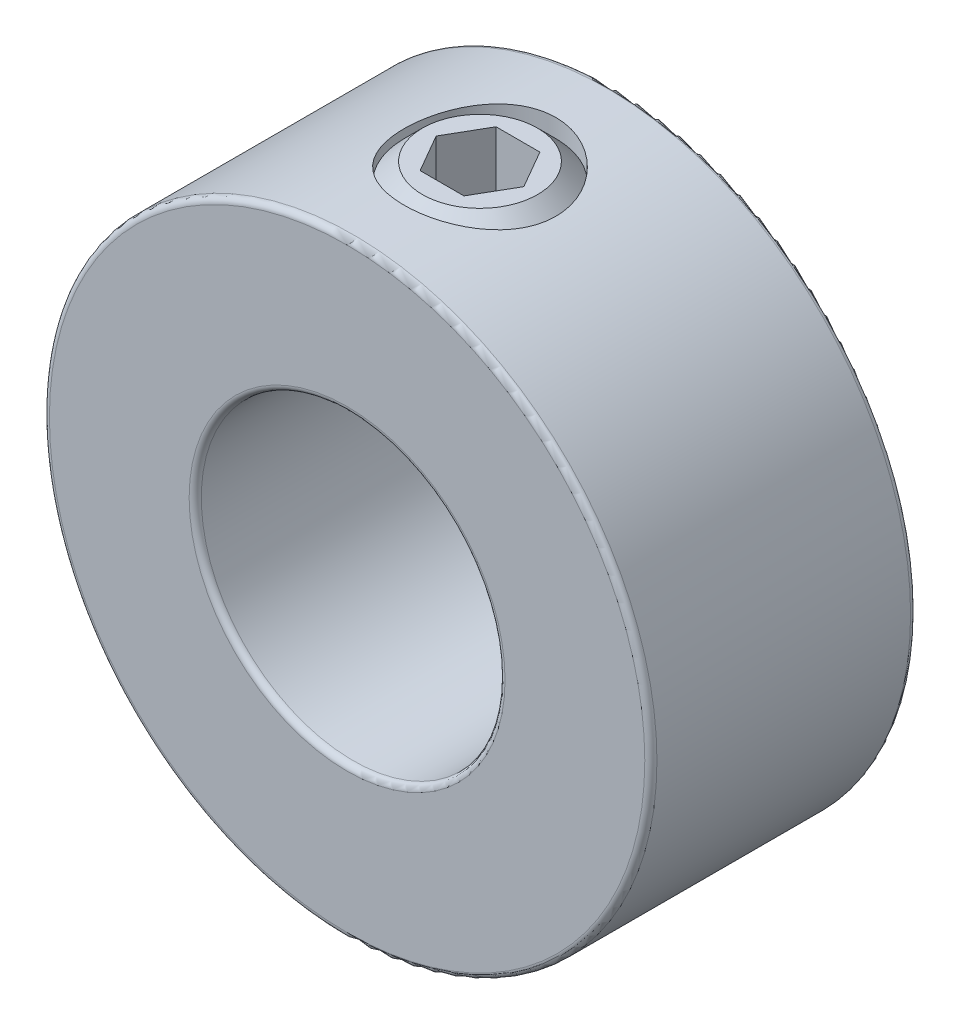
ISO-10303-21;
HEADER;
FILE_DESCRIPTION(('STEP AP214'),'2;1');
FILE_NAME('part.step','',(''),(''),'','','');
FILE_SCHEMA(('AUTOMOTIVE_DESIGN { 1 0 10303 214 1 1 1 1 }'));
ENDSEC;
DATA;
#1=APPLICATION_CONTEXT('core data for automotive mechanical design processes');
#2=APPLICATION_PROTOCOL_DEFINITION('international standard','automotive_design',2000,#1);
#3=PRODUCT_CONTEXT('',#1,'mechanical');
#4=PRODUCT('Part','Part','',(#3));
#5=PRODUCT_RELATED_PRODUCT_CATEGORY('part','',(#4));
#6=PRODUCT_DEFINITION_FORMATION('','',#4);
#7=PRODUCT_DEFINITION_CONTEXT('part definition',#1,'design');
#8=PRODUCT_DEFINITION('design','',#6,#7);
#9=PRODUCT_DEFINITION_SHAPE('','',#8);
#10=(LENGTH_UNIT() NAMED_UNIT(*) SI_UNIT(.MILLI.,.METRE.));
#11=(NAMED_UNIT(*) PLANE_ANGLE_UNIT() SI_UNIT($,.RADIAN.));
#12=(NAMED_UNIT(*) SI_UNIT($,.STERADIAN.) SOLID_ANGLE_UNIT());
#13=UNCERTAINTY_MEASURE_WITH_UNIT(LENGTH_MEASURE(1.E-05),#10,'distance_accuracy_value','');
#14=(GEOMETRIC_REPRESENTATION_CONTEXT(3) GLOBAL_UNCERTAINTY_ASSIGNED_CONTEXT((#13)) GLOBAL_UNIT_ASSIGNED_CONTEXT((#10,
#11,#12)) REPRESENTATION_CONTEXT('',''));
#15=CARTESIAN_POINT('',(0.,0.,0.));
#16=DIRECTION('',(0.,0.,1.));
#17=DIRECTION('',(1.,0.,0.));
#18=AXIS2_PLACEMENT_3D('',#15,#16,#17);
#19=CARTESIAN_POINT('',(0.,12.7,0.));
#20=DIRECTION('',(0.,1.,0.));
#21=DIRECTION('',(-1.,0.,0.));
#22=AXIS2_PLACEMENT_3D('',#19,#20,#21);
#23=PLANE('',#22);
#24=CARTESIAN_POINT('',(0.,12.7,0.));
#25=DIRECTION('',(0.,1.,0.));
#26=DIRECTION('',(-1.,0.,0.));
#27=AXIS2_PLACEMENT_3D('',#24,#25,#26);
#28=CIRCLE('',#27,2.40819263124403);
#29=CARTESIAN_POINT('',(-2.40819263124403,12.7,0.));
#30=VERTEX_POINT('',#29);
#31=EDGE_CURVE('E116',#30,#30,#28,.T.);
#32=ORIENTED_EDGE('',*,*,#31,.T.);
#33=EDGE_LOOP('',(#32));
#34=FACE_BOUND('',#33,.T.);
#35=DIRECTION('',(1.,0.,0.));
#36=VECTOR('',#35,1.);
#37=CARTESIAN_POINT('',(-0.916543552338531,12.7,-1.5875));
#38=LINE('',#37,#36);
#39=CARTESIAN_POINT('',(-0.916543552338531,12.7,-1.5875));
#40=VERTEX_POINT('',#39);
#41=CARTESIAN_POINT('',(0.91654355233853,12.7,-1.5875));
#42=VERTEX_POINT('',#41);
#43=EDGE_CURVE('E111',#40,#42,#38,.T.);
#44=ORIENTED_EDGE('',*,*,#43,.T.);
#45=DIRECTION('',(0.5,0.,0.866025403784439));
#46=VECTOR('',#45,1.);
#47=CARTESIAN_POINT('',(0.91654355233853,12.7,-1.5875));
#48=LINE('',#47,#46);
#49=CARTESIAN_POINT('',(1.83308710467706,12.7,0.));
#50=VERTEX_POINT('',#49);
#51=EDGE_CURVE('E57',#42,#50,#48,.T.);
#52=ORIENTED_EDGE('',*,*,#51,.T.);
#53=DIRECTION('',(-0.5,0.,0.866025403784439));
#54=VECTOR('',#53,1.);
#55=CARTESIAN_POINT('',(1.83308710467706,12.7,0.));
#56=LINE('',#55,#54);
#57=CARTESIAN_POINT('',(0.916543552338532,12.7,1.5875));
#58=VERTEX_POINT('',#57);
#59=EDGE_CURVE('E115',#50,#58,#56,.T.);
#60=ORIENTED_EDGE('',*,*,#59,.T.);
#61=DIRECTION('',(-1.,0.,0.));
#62=VECTOR('',#61,1.);
#63=CARTESIAN_POINT('',(0.916543552338532,12.7,1.5875));
#64=LINE('',#63,#62);
#65=CARTESIAN_POINT('',(-0.916543552338531,12.7,1.5875));
#66=VERTEX_POINT('',#65);
#67=EDGE_CURVE('E273',#58,#66,#64,.T.);
#68=ORIENTED_EDGE('',*,*,#67,.T.);
#69=DIRECTION('',(-0.5,0.,-0.866025403784438));
#70=VECTOR('',#69,1.);
#71=CARTESIAN_POINT('',(-0.916543552338531,12.7,1.5875));
#72=LINE('',#71,#70);
#73=CARTESIAN_POINT('',(-1.83308710467706,12.7,0.));
#74=VERTEX_POINT('',#73);
#75=EDGE_CURVE('E270',#66,#74,#72,.T.);
#76=ORIENTED_EDGE('',*,*,#75,.T.);
#77=DIRECTION('',(0.5,0.,-0.866025403784438));
#78=VECTOR('',#77,1.);
#79=CARTESIAN_POINT('',(-1.83308710467706,12.7,0.));
#80=LINE('',#79,#78);
#81=EDGE_CURVE('E264',#74,#40,#80,.T.);
#82=ORIENTED_EDGE('',*,*,#81,.T.);
#83=EDGE_LOOP('',(#44,#52,#60,#68,#76,#82));
#84=FACE_BOUND('',#83,.T.);
#85=ADVANCED_FACE('F42',(#34,#84),#23,.T.);
#86=CARTESIAN_POINT('',(0.,6.35,0.));
#87=DIRECTION('',(0.,-1.,0.));
#88=DIRECTION('',(1.,0.,0.));
#89=AXIS2_PLACEMENT_3D('',#86,#87,#88);
#90=CONICAL_SURFACE('',#89,0.920168842507158,0.785398163397448);
#91=CARTESIAN_POINT('',(0.,7.27016884250716,0.));
#92=VERTEX_POINT('',#91);
#93=VERTEX_LOOP('',#92);
#94=FACE_BOUND('',#93,.T.);
#95=CARTESIAN_POINT('',(0.,6.35,0.));
#96=DIRECTION('',(0.,1.,0.));
#97=DIRECTION('',(-1.,0.,0.));
#98=AXIS2_PLACEMENT_3D('',#95,#96,#97);
#99=CIRCLE('',#98,0.920168842507158);
#100=CARTESIAN_POINT('',(-0.920168842507158,6.35,0.));
#101=VERTEX_POINT('',#100);
#102=EDGE_CURVE('E12',#101,#101,#99,.T.);
#103=ORIENTED_EDGE('',*,*,#102,.F.);
#104=EDGE_LOOP('',(#103));
#105=FACE_BOUND('',#104,.T.);
#106=ADVANCED_FACE('F44',(#94,#105),#90,.F.);
#107=CARTESIAN_POINT('',(-2.40819263124403,6.35,0.));
#108=DIRECTION('',(0.,-1.,0.));
#109=DIRECTION('',(1.,0.,0.));
#110=AXIS2_PLACEMENT_3D('',#107,#108,#109);
#111=PLANE('',#110);
#112=ORIENTED_EDGE('',*,*,#102,.T.);
#113=EDGE_LOOP('',(#112));
#114=FACE_BOUND('',#113,.T.);
#115=CARTESIAN_POINT('',(0.,6.35,0.));
#116=DIRECTION('',(0.,1.,0.));
#117=DIRECTION('',(-1.,0.,0.));
#118=AXIS2_PLACEMENT_3D('',#115,#116,#117);
#119=CIRCLE('',#118,2.40819263124403);
#120=CARTESIAN_POINT('',(-2.40819263124403,6.35,0.));
#121=VERTEX_POINT('',#120);
#122=EDGE_CURVE('E50',#121,#121,#119,.T.);
#123=ORIENTED_EDGE('',*,*,#122,.F.);
#124=EDGE_LOOP('',(#123));
#125=FACE_BOUND('',#124,.T.);
#126=ADVANCED_FACE('F136',(#114,#125),#111,.T.);
#127=CARTESIAN_POINT('',(0.,7.11680736875596,0.));
#128=DIRECTION('',(0.,1.,0.));
#129=DIRECTION('',(-1.,0.,0.));
#130=AXIS2_PLACEMENT_3D('',#127,#128,#129);
#131=CONICAL_SURFACE('',#130,3.175,0.785398163397448);
#132=ORIENTED_EDGE('',*,*,#122,.T.);
#133=EDGE_LOOP('',(#132));
#134=FACE_BOUND('',#133,.T.);
#135=CARTESIAN_POINT('',(0.,7.11680736875596,0.));
#136=DIRECTION('',(0.,1.,0.));
#137=DIRECTION('',(-1.,0.,0.));
#138=AXIS2_PLACEMENT_3D('',#135,#136,#137);
#139=CIRCLE('',#138,3.175);
#140=CARTESIAN_POINT('',(-3.175,7.11680736875596,0.));
#141=VERTEX_POINT('',#140);
#142=EDGE_CURVE('E128',#141,#141,#139,.T.);
#143=ORIENTED_EDGE('',*,*,#142,.F.);
#144=EDGE_LOOP('',(#143));
#145=FACE_BOUND('',#144,.T.);
#146=ADVANCED_FACE('F133',(#134,#145),#131,.T.);
#147=CARTESIAN_POINT('',(0.,6.35,0.));
#148=DIRECTION('',(0.,1.,0.));
#149=DIRECTION('',(-1.,0.,0.));
#150=AXIS2_PLACEMENT_3D('',#147,#148,#149);
#151=CYLINDRICAL_SURFACE('',#150,3.175);
#152=ORIENTED_EDGE('',*,*,#142,.T.);
#153=EDGE_LOOP('',(#152));
#154=FACE_BOUND('',#153,.T.);
#155=CARTESIAN_POINT('',(0.,11.933192631244,0.));
#156=DIRECTION('',(0.,1.,0.));
#157=DIRECTION('',(-1.,0.,0.));
#158=AXIS2_PLACEMENT_3D('',#155,#156,#157);
#159=CIRCLE('',#158,3.175);
#160=CARTESIAN_POINT('',(-3.175,11.933192631244,0.));
#161=VERTEX_POINT('',#160);
#162=EDGE_CURVE('E120',#161,#161,#159,.T.);
#163=ORIENTED_EDGE('',*,*,#162,.F.);
#164=EDGE_LOOP('',(#163));
#165=FACE_BOUND('',#164,.T.);
#166=ADVANCED_FACE('F143',(#154,#165),#151,.T.);
#167=CARTESIAN_POINT('',(0.,12.7,0.));
#168=DIRECTION('',(0.,-1.,0.));
#169=DIRECTION('',(1.,0.,0.));
#170=AXIS2_PLACEMENT_3D('',#167,#168,#169);
#171=CONICAL_SURFACE('',#170,2.40819263124403,0.785398163397448);
#172=ORIENTED_EDGE('',*,*,#162,.T.);
#173=EDGE_LOOP('',(#172));
#174=FACE_BOUND('',#173,.T.);
#175=ORIENTED_EDGE('',*,*,#31,.F.);
#176=EDGE_LOOP('',(#175));
#177=FACE_BOUND('',#176,.T.);
#178=ADVANCED_FACE('F154',(#174,#177),#171,.T.);
#179=CARTESIAN_POINT('',(0.91654355233853,9.52499999999999,-1.5875));
#180=DIRECTION('',(-0.866025403784439,0.,0.5));
#181=DIRECTION('',(0.5,0.,0.866025403784439));
#182=AXIS2_PLACEMENT_3D('',#179,#180,#181);
#183=PLANE('',#182);
#184=ORIENTED_EDGE('',*,*,#51,.F.);
#185=DIRECTION('',(0.,1.,0.));
#186=VECTOR('',#185,1.);
#187=CARTESIAN_POINT('',(0.91654355233853,9.52499999999999,-1.5875));
#188=LINE('',#187,#186);
#189=CARTESIAN_POINT('',(0.91654355233853,9.52499999999999,-1.5875));
#190=VERTEX_POINT('',#189);
#191=EDGE_CURVE('E110',#190,#42,#188,.T.);
#192=ORIENTED_EDGE('',*,*,#191,.F.);
#193=DIRECTION('',(0.5,0.,0.866025403784439));
#194=VECTOR('',#193,1.);
#195=CARTESIAN_POINT('',(0.91654355233853,9.52499999999999,-1.5875));
#196=LINE('',#195,#194);
#197=CARTESIAN_POINT('',(1.83308710467706,9.52499999999999,0.));
#198=VERTEX_POINT('',#197);
#199=EDGE_CURVE('E101',#190,#198,#196,.T.);
#200=ORIENTED_EDGE('',*,*,#199,.T.);
#201=DIRECTION('',(0.,1.,0.));
#202=VECTOR('',#201,1.);
#203=CARTESIAN_POINT('',(1.83308710467706,9.52499999999999,0.));
#204=LINE('',#203,#202);
#205=EDGE_CURVE('E109',#198,#50,#204,.T.);
#206=ORIENTED_EDGE('',*,*,#205,.T.);
#207=EDGE_LOOP('',(#184,#192,#200,#206));
#208=FACE_BOUND('',#207,.T.);
#209=ADVANCED_FACE('F108',(#208),#183,.T.);
#210=CARTESIAN_POINT('',(1.83308710467706,9.52499999999999,0.));
#211=DIRECTION('',(-0.866025403784439,0.,-0.5));
#212=DIRECTION('',(-0.5,0.,0.866025403784439));
#213=AXIS2_PLACEMENT_3D('',#210,#211,#212);
#214=PLANE('',#213);
#215=ORIENTED_EDGE('',*,*,#59,.F.);
#216=ORIENTED_EDGE('',*,*,#205,.F.);
#217=DIRECTION('',(-0.5,0.,0.866025403784439));
#218=VECTOR('',#217,1.);
#219=CARTESIAN_POINT('',(1.83308710467706,9.52499999999999,0.));
#220=LINE('',#219,#218);
#221=CARTESIAN_POINT('',(0.916543552338532,9.52499999999999,1.5875));
#222=VERTEX_POINT('',#221);
#223=EDGE_CURVE('E97',#198,#222,#220,.T.);
#224=ORIENTED_EDGE('',*,*,#223,.T.);
#225=DIRECTION('',(0.,1.,0.));
#226=VECTOR('',#225,1.);
#227=CARTESIAN_POINT('',(0.916543552338532,9.52499999999999,1.5875));
#228=LINE('',#227,#226);
#229=EDGE_CURVE('E117',#222,#58,#228,.T.);
#230=ORIENTED_EDGE('',*,*,#229,.T.);
#231=EDGE_LOOP('',(#215,#216,#224,#230));
#232=FACE_BOUND('',#231,.T.);
#233=ADVANCED_FACE('F113',(#232),#214,.T.);
#234=CARTESIAN_POINT('',(0.916543552338532,9.52499999999999,1.5875));
#235=DIRECTION('',(0.,0.,-1.));
#236=DIRECTION('',(-1.,0.,0.));
#237=AXIS2_PLACEMENT_3D('',#234,#235,#236);
#238=PLANE('',#237);
#239=ORIENTED_EDGE('',*,*,#67,.F.);
#240=ORIENTED_EDGE('',*,*,#229,.F.);
#241=DIRECTION('',(-1.,0.,0.));
#242=VECTOR('',#241,1.);
#243=CARTESIAN_POINT('',(0.916543552338532,9.52499999999999,1.5875));
#244=LINE('',#243,#242);
#245=CARTESIAN_POINT('',(-0.916543552338531,9.52499999999999,1.5875));
#246=VERTEX_POINT('',#245);
#247=EDGE_CURVE('E103',#222,#246,#244,.T.);
#248=ORIENTED_EDGE('',*,*,#247,.T.);
#249=DIRECTION('',(0.,1.,0.));
#250=VECTOR('',#249,1.);
#251=CARTESIAN_POINT('',(-0.916543552338531,9.52499999999999,1.5875));
#252=LINE('',#251,#250);
#253=EDGE_CURVE('E122',#246,#66,#252,.T.);
#254=ORIENTED_EDGE('',*,*,#253,.T.);
#255=EDGE_LOOP('',(#239,#240,#248,#254));
#256=FACE_BOUND('',#255,.T.);
#257=ADVANCED_FACE('F184',(#256),#238,.T.);
#258=CARTESIAN_POINT('',(-0.916543552338531,9.52499999999999,1.5875));
#259=DIRECTION('',(0.866025403784439,0.,-0.5));
#260=DIRECTION('',(-0.5,0.,-0.866025403784439));
#261=AXIS2_PLACEMENT_3D('',#258,#259,#260);
#262=PLANE('',#261);
#263=ORIENTED_EDGE('',*,*,#75,.F.);
#264=ORIENTED_EDGE('',*,*,#253,.F.);
#265=DIRECTION('',(-0.5,0.,-0.866025403784438));
#266=VECTOR('',#265,1.);
#267=CARTESIAN_POINT('',(-0.916543552338531,9.52499999999999,1.5875));
#268=LINE('',#267,#266);
#269=CARTESIAN_POINT('',(-1.83308710467706,9.52499999999999,0.));
#270=VERTEX_POINT('',#269);
#271=EDGE_CURVE('E289',#246,#270,#268,.T.);
#272=ORIENTED_EDGE('',*,*,#271,.T.);
#273=DIRECTION('',(0.,1.,0.));
#274=VECTOR('',#273,1.);
#275=CARTESIAN_POINT('',(-1.83308710467706,9.52499999999999,0.));
#276=LINE('',#275,#274);
#277=EDGE_CURVE('E280',#270,#74,#276,.T.);
#278=ORIENTED_EDGE('',*,*,#277,.T.);
#279=EDGE_LOOP('',(#263,#264,#272,#278));
#280=FACE_BOUND('',#279,.T.);
#281=ADVANCED_FACE('F190',(#280),#262,.T.);
#282=CARTESIAN_POINT('',(-1.83308710467706,9.52499999999999,0.));
#283=DIRECTION('',(0.866025403784439,0.,0.5));
#284=DIRECTION('',(0.5,0.,-0.866025403784439));
#285=AXIS2_PLACEMENT_3D('',#282,#283,#284);
#286=PLANE('',#285);
#287=ORIENTED_EDGE('',*,*,#81,.F.);
#288=ORIENTED_EDGE('',*,*,#277,.F.);
#289=DIRECTION('',(0.5,0.,-0.866025403784438));
#290=VECTOR('',#289,1.);
#291=CARTESIAN_POINT('',(-1.83308710467706,9.52499999999999,0.));
#292=LINE('',#291,#290);
#293=CARTESIAN_POINT('',(-0.916543552338531,9.52499999999999,-1.5875));
#294=VERTEX_POINT('',#293);
#295=EDGE_CURVE('E287',#270,#294,#292,.T.);
#296=ORIENTED_EDGE('',*,*,#295,.T.);
#297=DIRECTION('',(0.,1.,0.));
#298=VECTOR('',#297,1.);
#299=CARTESIAN_POINT('',(-0.916543552338531,9.52499999999999,-1.5875));
#300=LINE('',#299,#298);
#301=EDGE_CURVE('E263',#294,#40,#300,.T.);
#302=ORIENTED_EDGE('',*,*,#301,.T.);
#303=EDGE_LOOP('',(#287,#288,#296,#302));
#304=FACE_BOUND('',#303,.T.);
#305=ADVANCED_FACE('F198',(#304),#286,.T.);
#306=CARTESIAN_POINT('',(-0.916543552338531,9.52499999999999,-1.5875));
#307=DIRECTION('',(0.,0.,1.));
#308=DIRECTION('',(1.,0.,0.));
#309=AXIS2_PLACEMENT_3D('',#306,#307,#308);
#310=PLANE('',#309);
#311=ORIENTED_EDGE('',*,*,#43,.F.);
#312=ORIENTED_EDGE('',*,*,#301,.F.);
#313=DIRECTION('',(1.,0.,0.));
#314=VECTOR('',#313,1.);
#315=CARTESIAN_POINT('',(-0.916543552338531,9.52499999999999,-1.5875));
#316=LINE('',#315,#314);
#317=EDGE_CURVE('E278',#294,#190,#316,.T.);
#318=ORIENTED_EDGE('',*,*,#317,.T.);
#319=ORIENTED_EDGE('',*,*,#191,.T.);
#320=EDGE_LOOP('',(#311,#312,#318,#319));
#321=FACE_BOUND('',#320,.T.);
#322=ADVANCED_FACE('F206',(#321),#310,.T.);
#323=CARTESIAN_POINT('',(0.,9.52499999999999,-3.175));
#324=DIRECTION('',(0.,1.,0.));
#325=DIRECTION('',(0.,0.,1.));
#326=AXIS2_PLACEMENT_3D('',#323,#324,#325);
#327=PLANE('',#326);
#328=ORIENTED_EDGE('',*,*,#199,.F.);
#329=ORIENTED_EDGE('',*,*,#317,.F.);
#330=ORIENTED_EDGE('',*,*,#295,.F.);
#331=ORIENTED_EDGE('',*,*,#271,.F.);
#332=ORIENTED_EDGE('',*,*,#247,.F.);
#333=ORIENTED_EDGE('',*,*,#223,.F.);
#334=EDGE_LOOP('',(#328,#329,#330,#331,#332,#333));
#335=FACE_BOUND('',#334,.T.);
#336=ADVANCED_FACE('F99',(#335),#327,.T.);
#337=CLOSED_SHELL('',(#85,#106,#126,#146,#166,#178,#209,#233,#257,#281,#305,#322,#336));
#338=MANIFOLD_SOLID_BREP('B2',#337);
#339=CARTESIAN_POINT('',(0.,0.,5.55625));
#340=DIRECTION('',(0.,0.,1.));
#341=DIRECTION('',(1.,0.,0.));
#342=AXIS2_PLACEMENT_3D('',#339,#340,#341);
#343=PLANE('',#342);
#344=CARTESIAN_POINT('',(0.,0.,5.55625));
#345=DIRECTION('',(0.,0.,1.));
#346=DIRECTION('',(1.,0.,0.));
#347=AXIS2_PLACEMENT_3D('',#344,#345,#346);
#348=CIRCLE('',#347,6.604);
#349=CARTESIAN_POINT('',(6.604,0.,5.55625));
#350=VERTEX_POINT('',#349);
#351=EDGE_CURVE('E307',#350,#350,#348,.F.);
#352=ORIENTED_EDGE('',*,*,#351,.T.);
#353=EDGE_LOOP('',(#352));
#354=FACE_BOUND('',#353,.T.);
#355=CARTESIAN_POINT('',(0.,0.,5.55625));
#356=DIRECTION('',(0.,0.,1.));
#357=DIRECTION('',(1.,0.,0.));
#358=AXIS2_PLACEMENT_3D('',#355,#356,#357);
#359=CIRCLE('',#358,12.446);
#360=CARTESIAN_POINT('',(12.446,0.,5.55625));
#361=VERTEX_POINT('',#360);
#362=EDGE_CURVE('E311',#361,#361,#359,.T.);
#363=ORIENTED_EDGE('',*,*,#362,.T.);
#364=EDGE_LOOP('',(#363));
#365=FACE_BOUND('',#364,.T.);
#366=ADVANCED_FACE('F296',(#354,#365),#343,.T.);
#367=CARTESIAN_POINT('',(0.,0.,-5.55625));
#368=DIRECTION('',(0.,0.,1.));
#369=DIRECTION('',(1.,0.,0.));
#370=AXIS2_PLACEMENT_3D('',#367,#368,#369);
#371=PLANE('',#370);
#372=CARTESIAN_POINT('',(0.,0.,-5.55625));
#373=DIRECTION('',(0.,0.,1.));
#374=DIRECTION('',(1.,0.,0.));
#375=AXIS2_PLACEMENT_3D('',#372,#373,#374);
#376=CIRCLE('',#375,6.604);
#377=CARTESIAN_POINT('',(6.604,0.,-5.55625));
#378=VERTEX_POINT('',#377);
#379=EDGE_CURVE('E322',#378,#378,#376,.T.);
#380=ORIENTED_EDGE('',*,*,#379,.T.);
#381=EDGE_LOOP('',(#380));
#382=FACE_BOUND('',#381,.T.);
#383=CARTESIAN_POINT('',(0.,0.,-5.55625));
#384=DIRECTION('',(0.,0.,1.));
#385=DIRECTION('',(1.,0.,0.));
#386=AXIS2_PLACEMENT_3D('',#383,#384,#385);
#387=CIRCLE('',#386,12.446);
#388=CARTESIAN_POINT('',(12.446,0.,-5.55625));
#389=VERTEX_POINT('',#388);
#390=EDGE_CURVE('E325',#389,#389,#387,.F.);
#391=ORIENTED_EDGE('',*,*,#390,.T.);
#392=EDGE_LOOP('',(#391));
#393=FACE_BOUND('',#392,.T.);
#394=ADVANCED_FACE('F361',(#382,#393),#371,.F.);
#395=CARTESIAN_POINT('',(0.,0.,5.55625));
#396=DIRECTION('',(0.,0.,-1.));
#397=DIRECTION('',(-1.,0.,0.));
#398=AXIS2_PLACEMENT_3D('',#395,#396,#397);
#399=CYLINDRICAL_SURFACE('',#398,12.7);
#400=CARTESIAN_POINT('',(0.,0.,-5.30225));
#401=DIRECTION('',(0.,0.,1.));
#402=DIRECTION('',(1.,0.,0.));
#403=AXIS2_PLACEMENT_3D('',#400,#401,#402);
#404=CIRCLE('',#403,12.7);
#405=CARTESIAN_POINT('',(12.7,0.,-5.30225));
#406=VERTEX_POINT('',#405);
#407=EDGE_CURVE('E41',#406,#406,#404,.T.);
#408=ORIENTED_EDGE('',*,*,#407,.T.);
#409=EDGE_LOOP('',(#408));
#410=FACE_BOUND('',#409,.T.);
#411=CARTESIAN_POINT('',(0.,0.,5.30225));
#412=DIRECTION('',(0.,0.,1.));
#413=DIRECTION('',(1.,0.,0.));
#414=AXIS2_PLACEMENT_3D('',#411,#412,#413);
#415=CIRCLE('',#414,12.7);
#416=CARTESIAN_POINT('',(12.7,0.,5.30225));
#417=VERTEX_POINT('',#416);
#418=EDGE_CURVE('E303',#417,#417,#415,.F.);
#419=ORIENTED_EDGE('',*,*,#418,.T.);
#420=EDGE_LOOP('',(#419));
#421=FACE_BOUND('',#420,.T.);
#422=CARTESIAN_POINT('',(0.,12.7,-3.175));
#423=CARTESIAN_POINT('',(0.175421054350931,12.6999970338729,-3.17499507718756));
#424=CARTESIAN_POINT('',(0.350897100741782,12.6963292371237,-3.16041288419548));
#425=CARTESIAN_POINT('',(0.69682005198096,12.6820530760661,-3.10255676306683));
#426=CARTESIAN_POINT('',(0.867264049209731,12.6714407780562,-3.05926657314488));
#427=CARTESIAN_POINT('',(1.19807751278645,12.6444507573613,-2.94547024683858));
#428=CARTESIAN_POINT('',(1.35845880926017,12.6280799601569,-2.87499679271934));
#429=CARTESIAN_POINT('',(1.6651226791977,12.591316443928,-2.70894939107175));
#430=CARTESIAN_POINT('',(1.81140477687155,12.5709235892463,-2.61337459688152));
#431=CARTESIAN_POINT('',(2.08873074612027,12.5278602543575,-2.39775832856532));
#432=CARTESIAN_POINT('',(2.2194428772959,12.5051546346353,-2.27729716633665));
#433=CARTESIAN_POINT('',(2.45903522924702,12.4602582924963,-2.01622616627587));
#434=CARTESIAN_POINT('',(2.56791298487579,12.4380676284689,-1.87561405642898));
#435=CARTESIAN_POINT('',(2.76230618225783,12.3963594189446,-1.57565677007337));
#436=CARTESIAN_POINT('',(2.84745052370821,12.3768864828385,-1.41606432812152));
#437=CARTESIAN_POINT('',(2.98957345643241,12.343330973648,-1.08426586198626));
#438=CARTESIAN_POINT('',(3.04655655068163,12.3292475388652,-0.912061859447231));
#439=CARTESIAN_POINT('',(3.12960773790342,12.3084267567388,-0.563576262139818));
#440=CARTESIAN_POINT('',(3.15627230130284,12.3015478927701,-0.387445470052915));
#441=CARTESIAN_POINT('',(3.17978742389056,12.2954915053947,-0.0330865289513835));
#442=CARTESIAN_POINT('',(3.176642833515,12.2963127290578,0.145141274131692));
#443=CARTESIAN_POINT('',(3.14110481048737,12.3054365167726,0.494063459727666));
#444=CARTESIAN_POINT('',(3.10942215340351,12.3135572669877,0.664835732101618));
#445=CARTESIAN_POINT('',(3.01884119561133,12.3360753547043,0.998560891095076));
#446=CARTESIAN_POINT('',(2.95994095604688,12.3504731393489,1.16151321974455));
#447=CARTESIAN_POINT('',(2.81599106163371,12.3840899110031,1.47687880106701));
#448=CARTESIAN_POINT('',(2.73068344564301,12.4033560981111,1.62916906362126));
#449=CARTESIAN_POINT('',(2.53652078423164,12.4445122129068,1.91752793565194));
#450=CARTESIAN_POINT('',(2.42766161831204,12.4664025994163,2.05359370007568));
#451=CARTESIAN_POINT('',(2.18580424890858,12.5111061380944,2.30971431988649));
#452=CARTESIAN_POINT('',(2.05220624645107,12.533927803951,2.42920200396319));
#453=CARTESIAN_POINT('',(1.76659522538283,12.5773596047503,2.64418496321526));
#454=CARTESIAN_POINT('',(1.61458164448181,12.5979696721291,2.73967950552455));
#455=CARTESIAN_POINT('',(1.29564529770895,12.6347586626604,2.90417374084162));
#456=CARTESIAN_POINT('',(1.12867311562492,12.6509221227036,2.97308130353854));
#457=CARTESIAN_POINT('',(0.785020883902435,12.676884242985,3.0816916304186));
#458=CARTESIAN_POINT('',(0.608342698201859,12.6866841206814,3.12139998108506));
#459=CARTESIAN_POINT('',(0.255142937325556,12.6986347345774,3.16961851376621));
#460=CARTESIAN_POINT('',(0.078733057308377,12.7009747992585,3.17890107185939));
#461=CARTESIAN_POINT('',(-0.273119584996527,12.6982813685726,3.16812294564922));
#462=CARTESIAN_POINT('',(-0.448562432914396,12.6932485369526,3.14806490274183));
#463=CARTESIAN_POINT('',(-0.790816868910238,12.6764961338622,3.07981157723825));
#464=CARTESIAN_POINT('',(-0.957717835150521,12.6648767569325,3.03203765897374));
#465=CARTESIAN_POINT('',(-1.28112793569116,12.6362609570897,2.91019000547309));
#466=CARTESIAN_POINT('',(-1.43763601861911,12.6192639911647,2.83611361420368));
#467=CARTESIAN_POINT('',(-1.73889063454314,12.5813250177716,2.6622668605486));
#468=CARTESIAN_POINT('',(-1.88337918521903,12.5603183592593,2.56206389542727));
#469=CARTESIAN_POINT('',(-2.15376466554501,12.5167921111412,2.33936135971267));
#470=CARTESIAN_POINT('',(-2.27965837982672,12.4942722608556,2.21685794114268));
#471=CARTESIAN_POINT('',(-2.51246336908675,12.4495762556412,1.94944584954746));
#472=CARTESIAN_POINT('',(-2.6188328531313,12.4274221051899,1.80406102865082));
#473=CARTESIAN_POINT('',(-2.80566443991221,12.3865825924258,1.49704925704163));
#474=CARTESIAN_POINT('',(-2.88612769264178,12.3678970761538,1.335423027713));
#475=CARTESIAN_POINT('',(-3.0182638402854,12.3363163381503,1.00138288757303));
#476=CARTESIAN_POINT('',(-3.07010730622843,12.3233869021911,0.829039853404032));
#477=CARTESIAN_POINT('',(-3.14398164687971,12.3047494152553,0.477711266541238));
#478=CARTESIAN_POINT('',(-3.16601904149253,12.299039785006,0.298727175343936));
#479=CARTESIAN_POINT('',(-3.17931501621074,12.2956087422145,-0.0552895005203962));
#480=CARTESIAN_POINT('',(-3.17143955029538,12.2976625750886,-0.230287904387485));
#481=CARTESIAN_POINT('',(-3.1271152390873,12.3090074061494,-0.576376564376255));
#482=CARTESIAN_POINT('',(-3.09066696801937,12.3182982588945,-0.747466898966899));
#483=CARTESIAN_POINT('',(-2.9907046261569,12.3429450180984,-1.07994123834368));
#484=CARTESIAN_POINT('',(-2.92735297324093,12.3582644892528,-1.24137696275537));
#485=CARTESIAN_POINT('',(-2.7755107337966,12.3932474960913,-1.5514433934137));
#486=CARTESIAN_POINT('',(-2.68701666057215,12.4129116342002,-1.70007231991313));
#487=CARTESIAN_POINT('',(-2.48468673461549,12.4550092586011,-1.98449063138675));
#488=CARTESIAN_POINT('',(-2.37025002816433,12.4775016056118,-2.11984393874715));
#489=CARTESIAN_POINT('',(-2.12045416901821,12.5223699100401,-2.36970791148384));
#490=CARTESIAN_POINT('',(-1.98509005500274,12.5447458385544,-2.48421362040584));
#491=CARTESIAN_POINT('',(-1.6943230585205,12.5873437112106,-2.69115393646168));
#492=CARTESIAN_POINT('',(-1.53860166056969,12.6075193062447,-2.78315126560482));
#493=CARTESIAN_POINT('',(-1.21341315929717,12.6429542453062,-2.93951546322414));
#494=CARTESIAN_POINT('',(-1.04395600927443,12.6582171100619,-3.0039021300394));
#495=CARTESIAN_POINT('',(-0.729001702698682,12.6798505941374,-3.09366037419776));
#496=CARTESIAN_POINT('',(-0.585004695088745,12.6873547169486,-3.12409679779643));
#497=CARTESIAN_POINT('',(-0.294017851418465,12.6974304774096,-3.16476791399977));
#498=CARTESIAN_POINT('',(-0.147028241296871,12.7000024860439,-3.17500412602955));
#499=CARTESIAN_POINT('',(0.,12.7,-3.175));
#500=B_SPLINE_CURVE_WITH_KNOTS('',3,(#422,#423,#424,#425,#426,#427,#428,#429,#430,#431,#432,
#433,#434,#435,#436,#437,#438,#439,#440,#441,#442,#443,#444,#445,#446,#447,#448,#449,#450,#451,
#452,#453,#454,#455,#456,#457,#458,#459,#460,#461,#462,#463,#464,#465,#466,#467,#468,#469,#470,
#471,#472,#473,#474,#475,#476,#477,#478,#479,#480,#481,#482,#483,#484,#485,#486,#487,#488,#489,
#490,#491,#492,#493,#494,#495,#496,#497,#498,#499),.UNSPECIFIED.,.T.,.F.,(4,2,2,2,2,2,2,2,2,2,2,
2,2,2,2,2,2,2,2,2,2,2,2,2,2,2,2,2,2,2,2,2,2,2,2,2,2,2,4),(0.,0.5257243580655,1.05174676993359,
1.57713870983892,2.10254837335841,2.63767221675277,3.17285644277797,3.71599137305291,
4.25903942808496,4.79120824630597,5.3232904734557,5.84247618671883,6.36169889010143,
6.88616284006739,7.41071862276906,7.95023177058119,8.48976139571985,9.0311441807632,
9.57242335981323,10.09985087283,10.6272309069567,11.1467958106174,11.6664131950588,
12.1952509368702,12.7241800170734,13.266092111565,13.8079801469349,14.34660272276,
14.885107458967,15.4081433519175,15.9311687337377,16.4510804786766,16.9710643590661,
17.5046127008447,18.0382877269755,18.5816279265763,19.1245778677202,19.5652441424438,
20.005877269746),.UNSPECIFIED.);
#501=CARTESIAN_POINT('',(0.,12.7,-3.175));
#502=VERTEX_POINT('',#501);
#503=EDGE_CURVE('E328',#502,#502,#500,.T.);
#504=ORIENTED_EDGE('',*,*,#503,.T.);
#505=EDGE_LOOP('',(#504));
#506=FACE_BOUND('',#505,.T.);
#507=ADVANCED_FACE('F357',(#410,#421,#506),#399,.T.);
#508=CARTESIAN_POINT('',(0.,0.,5.55625));
#509=DIRECTION('',(0.,0.,-1.));
#510=DIRECTION('',(-1.,0.,0.));
#511=AXIS2_PLACEMENT_3D('',#508,#509,#510);
#512=CYLINDRICAL_SURFACE('',#511,6.35);
#513=CARTESIAN_POINT('',(0.,0.,-5.30225));
#514=DIRECTION('',(0.,0.,1.));
#515=DIRECTION('',(1.,0.,0.));
#516=AXIS2_PLACEMENT_3D('',#513,#514,#515);
#517=CIRCLE('',#516,6.35);
#518=CARTESIAN_POINT('',(6.35,0.,-5.30225));
#519=VERTEX_POINT('',#518);
#520=EDGE_CURVE('E316',#519,#519,#517,.F.);
#521=ORIENTED_EDGE('',*,*,#520,.T.);
#522=EDGE_LOOP('',(#521));
#523=FACE_BOUND('',#522,.T.);
#524=CARTESIAN_POINT('',(0.,0.,5.30225));
#525=DIRECTION('',(0.,0.,1.));
#526=DIRECTION('',(1.,0.,0.));
#527=AXIS2_PLACEMENT_3D('',#524,#525,#526);
#528=CIRCLE('',#527,6.35);
#529=CARTESIAN_POINT('',(6.35,0.,5.30225));
#530=VERTEX_POINT('',#529);
#531=EDGE_CURVE('E319',#530,#530,#528,.T.);
#532=ORIENTED_EDGE('',*,*,#531,.T.);
#533=EDGE_LOOP('',(#532));
#534=FACE_BOUND('',#533,.T.);
#535=CARTESIAN_POINT('',(0.,6.35,-3.175));
#536=CARTESIAN_POINT('',(0.0834969220594998,6.34999931166444,-3.17499911228237));
#537=CARTESIAN_POINT('',(0.167002655580042,6.34834758911701,-3.17170012555404));
#538=CARTESIAN_POINT('',(0.333378330258781,6.34179105821714,-3.1585541254501));
#539=CARTESIAN_POINT('',(0.416247978955771,6.33688483467113,-3.14870426347422));
#540=CARTESIAN_POINT('',(0.66318203064701,6.31742426748325,-3.10942793495398));
#541=CARTESIAN_POINT('',(0.825450146761554,6.29812827299425,-3.0702749225986));
#542=CARTESIAN_POINT('',(1.13965128900426,6.2489182313574,-2.96800928870585));
#543=CARTESIAN_POINT('',(1.29162180811868,6.21904547786825,-2.90498978075659));
#544=CARTESIAN_POINT('',(1.58264035037879,6.15142812041637,-2.7572639263711));
#545=CARTESIAN_POINT('',(1.72168939123018,6.11368413715877,-2.67255928984904));
#546=CARTESIAN_POINT('',(1.99234108848171,6.03111096182982,-2.47803037026577));
#547=CARTESIAN_POINT('',(2.12298433900091,5.98599127270818,-2.36699642220607));
#548=CARTESIAN_POINT('',(2.36467069069853,5.89470535591056,-2.12560331642721));
#549=CARTESIAN_POINT('',(2.47569885601321,5.84853836069043,-1.99522957023356));
#550=CARTESIAN_POINT('',(2.68368848497886,5.75623634934464,-1.70657905224668));
#551=CARTESIAN_POINT('',(2.77889135161934,5.71038146176788,-1.54692246869841));
#552=CARTESIAN_POINT('',(2.90019349951534,5.64919759286363,-1.29545201282556));
#553=CARTESIAN_POINT('',(2.93705266116891,5.63006420805933,-1.20959993817132));
#554=CARTESIAN_POINT('',(3.00322508739606,5.59504604853268,-1.03441438629357));
#555=CARTESIAN_POINT('',(3.03254280972159,5.57915935583429,-0.945083001819443));
#556=CARTESIAN_POINT('',(3.08174263292982,5.55212611635049,-0.768989448035253));
#557=CARTESIAN_POINT('',(3.10208128111978,5.54075429137746,-0.682389205971432));
#558=CARTESIAN_POINT('',(3.13545600360765,5.52193654886444,-0.507412721005597));
#559=CARTESIAN_POINT('',(3.14849595237257,5.51448854851135,-0.419037446228295));
#560=CARTESIAN_POINT('',(3.1670771305344,5.50383875782919,-0.241293261151379));
#561=CARTESIAN_POINT('',(3.17262287599649,5.50063441026522,-0.151924982012598));
#562=CARTESIAN_POINT('',(3.17614778806993,5.49859788398609,0.026980784178089));
#563=CARTESIAN_POINT('',(3.17412767659872,5.49976528812799,0.116518254271341));
#564=CARTESIAN_POINT('',(3.1581193033026,5.50899190362733,0.362747875724408));
#565=CARTESIAN_POINT('',(3.13621253452965,5.52160857357707,0.518841729813368));
#566=CARTESIAN_POINT('',(3.07003746372168,5.55866493052824,0.824646641306534));
#567=CARTESIAN_POINT('',(3.02576203854504,5.58310838358077,0.974355649022768));
#568=CARTESIAN_POINT('',(2.91531509833647,5.64157885407237,1.26754429656415));
#569=CARTESIAN_POINT('',(2.84865758129417,5.67581583876129,1.41079760993663));
#570=CARTESIAN_POINT('',(2.69570761526054,5.75003268807633,1.68476608617402));
#571=CARTESIAN_POINT('',(2.60940634674629,5.79001512927804,1.81547557960851));
#572=CARTESIAN_POINT('',(2.40685964249565,5.87734289018611,2.0781042742503));
#573=CARTESIAN_POINT('',(2.28820488335253,5.92497898403936,2.20807538485651));
#574=CARTESIAN_POINT('',(2.03058898448427,6.01813700574905,2.44708514286385));
#575=CARTESIAN_POINT('',(1.89161819563546,6.06365791538158,2.5561137863587));
#576=CARTESIAN_POINT('',(1.58913989972482,6.1500381059768,2.75490191971972));
#577=CARTESIAN_POINT('',(1.42479265164788,6.19058274974572,2.84353148557995));
#578=CARTESIAN_POINT('',(1.08098023585583,6.25976272299952,2.99115808163535));
#579=CARTESIAN_POINT('',(0.901527205073894,6.28840750578946,3.05017864113171));
#580=CARTESIAN_POINT('',(0.548533610626832,6.32854759690358,3.13205940339905));
#581=CARTESIAN_POINT('',(0.375734359385243,6.34126679122995,3.15750967258734));
#582=CARTESIAN_POINT('',(0.0278752299448304,6.35231817716325,3.17965052226026));
#583=CARTESIAN_POINT('',(-0.14718353806002,6.35065718436129,3.17635472713933));
#584=CARTESIAN_POINT('',(-0.480164686080363,6.33384535408399,3.14259376405461));
#585=CARTESIAN_POINT('',(-0.638363620564191,6.31975005060431,3.11425420852516));
#586=CARTESIAN_POINT('',(-0.947441883053002,6.28085393924121,3.03454412179011));
#587=CARTESIAN_POINT('',(-1.09832040207141,6.25605195113515,2.98317105152272));
#588=CARTESIAN_POINT('',(-1.39347133182512,6.19709998236334,2.8575048690622));
#589=CARTESIAN_POINT('',(-1.53743151047822,6.16270299610717,2.78259841588881));
#590=CARTESIAN_POINT('',(-1.8112148234104,6.08787118465664,2.61268357431413));
#591=CARTESIAN_POINT('',(-1.94103189959928,6.0474337895468,2.5176666226146));
#592=CARTESIAN_POINT('',(-2.19636241342679,5.95973602709938,2.29946064962623));
#593=CARTESIAN_POINT('',(-2.3202013468198,5.91219559251098,2.17442139288844));
#594=CARTESIAN_POINT('',(-2.54589381918874,5.81858093231368,1.90523764485025));
#595=CARTESIAN_POINT('',(-2.6477321493525,5.77250773963547,1.76108004761907));
#596=CARTESIAN_POINT('',(-2.83117262876716,5.68487535288742,1.44893139804165));
#597=CARTESIAN_POINT('',(-2.91155594998014,5.64364281441821,1.28012423048962));
#598=CARTESIAN_POINT('',(-3.04191297152938,5.5744767953732,0.928655535110328));
#599=CARTESIAN_POINT('',(-3.0919258549222,5.54652618900869,0.746012202152618));
#600=CARTESIAN_POINT('',(-3.15551086037918,5.51057765714603,0.390810043529834));
#601=CARTESIAN_POINT('',(-3.17212027309711,5.50092192343245,0.218966249592787));
#602=CARTESIAN_POINT('',(-3.17718805563876,5.49800001145358,-0.125244442495205));
#603=CARTESIAN_POINT('',(-3.16565862768385,5.50472672904441,-0.297611081542638));
#604=CARTESIAN_POINT('',(-3.11761548073658,5.53205211477784,-0.620660103073908));
#605=CARTESIAN_POINT('',(-3.08358651207686,5.5512682307627,-0.771843941731147));
#606=CARTESIAN_POINT('',(-2.99458164828807,5.59977978302582,-1.06619083016717));
#607=CARTESIAN_POINT('',(-2.93959901505999,5.62907846127335,-1.2093512828503));
#608=CARTESIAN_POINT('',(-2.8061154442137,5.69685576337174,-1.49423369942854));
#609=CARTESIAN_POINT('',(-2.72628260503929,5.73581889480533,-1.63521280936567));
#610=CARTESIAN_POINT('',(-2.54682759156583,5.81772207082382,-1.9026974317231));
#611=CARTESIAN_POINT('',(-2.44719512169931,5.8606641782013,-2.02919535994271));
#612=CARTESIAN_POINT('',(-2.21680287661218,5.95192753761204,-2.28009752417706));
#613=CARTESIAN_POINT('',(-2.08373188558712,6.00026839877347,-2.40237975641279));
#614=CARTESIAN_POINT('',(-1.79751265125243,6.0921234557675,-2.62339787323311));
#615=CARTESIAN_POINT('',(-1.64435365457427,6.13563504323043,-2.72212106598272));
#616=CARTESIAN_POINT('',(-1.40178715704487,6.19391073190243,-2.85028026619707));
#617=CARTESIAN_POINT('',(-1.31842200030918,6.21223173271383,-2.88980058368139));
#618=CARTESIAN_POINT('',(-1.1480770102167,6.24595363475604,-2.9615994748237));
#619=CARTESIAN_POINT('',(-1.06109897786306,6.26135597012704,-2.99388160653437));
#620=CARTESIAN_POINT('',(-0.884361322813102,6.28875097111981,-3.050759345915));
#621=CARTESIAN_POINT('',(-0.794608244970565,6.30075106809478,-3.07537171813811));
#622=CARTESIAN_POINT('',(-0.612925661591577,6.32100983571903,-3.11666738952989));
#623=CARTESIAN_POINT('',(-0.520997521680286,6.3292707916836,-3.13335553219354));
#624=CARTESIAN_POINT('',(-0.357531347524372,6.34032503263334,-3.15561628486238));
#625=CARTESIAN_POINT('',(-0.286274046488593,6.34394670812889,-3.16287882124963));
#626=CARTESIAN_POINT('',(-0.143346668941345,6.34878452045567,-3.17257112653757));
#627=CARTESIAN_POINT('',(-0.0716765810914251,6.35000059089052,-3.17500076204682));
#628=CARTESIAN_POINT('',(0.,6.35,-3.175));
#629=B_SPLINE_CURVE_WITH_KNOTS('',3,(#535,#536,#537,#538,#539,#540,#541,#542,#543,#544,#545,
#546,#547,#548,#549,#550,#551,#552,#553,#554,#555,#556,#557,#558,#559,#560,#561,#562,#563,#564,
#565,#566,#567,#568,#569,#570,#571,#572,#573,#574,#575,#576,#577,#578,#579,#580,#581,#582,#583,
#584,#585,#586,#587,#588,#589,#590,#591,#592,#593,#594,#595,#596,#597,#598,#599,#600,#601,#602,
#603,#604,#605,#606,#607,#608,#609,#610,#611,#612,#613,#614,#615,#616,#617,#618,#619,#620,#621,
#622,#623,#624,#625,#626,#627,#628),.UNSPECIFIED.,.T.,.F.,(4,2,2,2,2,2,2,2,2,2,2,2,2,2,2,2,2,2,
2,2,2,2,2,2,2,2,2,2,2,2,2,2,2,2,2,2,2,2,2,2,2,2,2,2,2,2,4),(0.,0.25041561210268,
0.500940186864014,1.00234854488129,1.50182051324263,2.00125310940106,2.53090025348452,
3.06094897410615,3.63210298373098,3.91787290005988,4.20347350732849,4.47213270490102,
4.74064915090148,5.00900371453887,5.27733267302576,5.74927594687739,6.22136960256846,
6.70445970327764,7.18776712794021,7.73235646527881,8.27720530143646,8.84735553323666,
9.41705196489304,9.93956405039339,10.4618285011675,10.9436138594975,11.4254523397102,
11.9210677568139,12.4168946391879,12.9614122158798,13.5063050164601,14.0775857365549,
14.6481278321882,15.1639000911419,15.6794487286237,16.1458838633213,16.6124691169503,
17.1104020806943,17.6085946442304,18.1673210354482,18.7263477502426,19.0082017078365,
19.2899168101042,19.5710117490933,19.8519346536844,20.0668939492148,20.2818591776892),.UNSPECIFIED.);
#630=CARTESIAN_POINT('',(0.,6.35,-3.175));
#631=VERTEX_POINT('',#630);
#632=EDGE_CURVE('E329',#631,#631,#629,.T.);
#633=ORIENTED_EDGE('',*,*,#632,.F.);
#634=EDGE_LOOP('',(#633));
#635=FACE_BOUND('',#634,.T.);
#636=ADVANCED_FACE('F341',(#523,#534,#635),#512,.F.);
#637=CARTESIAN_POINT('',(0.,12.7,0.));
#638=DIRECTION('',(0.,-1.,0.));
#639=DIRECTION('',(0.,0.,-1.));
#640=AXIS2_PLACEMENT_3D('',#637,#638,#639);
#641=CYLINDRICAL_SURFACE('',#640,3.175);
#642=ORIENTED_EDGE('',*,*,#632,.T.);
#643=EDGE_LOOP('',(#642));
#644=FACE_BOUND('',#643,.T.);
#645=ORIENTED_EDGE('',*,*,#503,.F.);
#646=EDGE_LOOP('',(#645));
#647=FACE_BOUND('',#646,.T.);
#648=ADVANCED_FACE('F344',(#644,#647),#641,.F.);
#649=CARTESIAN_POINT('',(0.,0.,-5.30225));
#650=DIRECTION('',(0.,0.,1.));
#651=DIRECTION('',(1.,0.,0.));
#652=AXIS2_PLACEMENT_3D('',#649,#650,#651);
#653=TOROIDAL_SURFACE('',#652,6.604,0.254);
#654=ORIENTED_EDGE('',*,*,#520,.F.);
#655=EDGE_LOOP('',(#654));
#656=FACE_BOUND('',#655,.T.);
#657=ORIENTED_EDGE('',*,*,#379,.F.);
#658=EDGE_LOOP('',(#657));
#659=FACE_BOUND('',#658,.T.);
#660=ADVANCED_FACE('F347',(#656,#659),#653,.T.);
#661=CARTESIAN_POINT('',(0.,0.,5.30225));
#662=DIRECTION('',(0.,0.,1.));
#663=DIRECTION('',(1.,0.,0.));
#664=AXIS2_PLACEMENT_3D('',#661,#662,#663);
#665=TOROIDAL_SURFACE('',#664,6.604,0.254);
#666=ORIENTED_EDGE('',*,*,#351,.F.);
#667=EDGE_LOOP('',(#666));
#668=FACE_BOUND('',#667,.T.);
#669=ORIENTED_EDGE('',*,*,#531,.F.);
#670=EDGE_LOOP('',(#669));
#671=FACE_BOUND('',#670,.T.);
#672=ADVANCED_FACE('F354',(#668,#671),#665,.T.);
#673=CARTESIAN_POINT('',(0.,0.,-5.30225));
#674=DIRECTION('',(0.,0.,1.));
#675=DIRECTION('',(1.,0.,0.));
#676=AXIS2_PLACEMENT_3D('',#673,#674,#675);
#677=TOROIDAL_SURFACE('',#676,12.446,0.254);
#678=ORIENTED_EDGE('',*,*,#390,.F.);
#679=EDGE_LOOP('',(#678));
#680=FACE_BOUND('',#679,.T.);
#681=ORIENTED_EDGE('',*,*,#407,.F.);
#682=EDGE_LOOP('',(#681));
#683=FACE_BOUND('',#682,.T.);
#684=ADVANCED_FACE('F373',(#680,#683),#677,.T.);
#685=CARTESIAN_POINT('',(0.,0.,5.30225));
#686=DIRECTION('',(0.,0.,1.));
#687=DIRECTION('',(1.,0.,0.));
#688=AXIS2_PLACEMENT_3D('',#685,#686,#687);
#689=TOROIDAL_SURFACE('',#688,12.446,0.254);
#690=ORIENTED_EDGE('',*,*,#418,.F.);
#691=EDGE_LOOP('',(#690));
#692=FACE_BOUND('',#691,.T.);
#693=ORIENTED_EDGE('',*,*,#362,.F.);
#694=EDGE_LOOP('',(#693));
#695=FACE_BOUND('',#694,.T.);
#696=ADVANCED_FACE('F298',(#692,#695),#689,.T.);
#697=CLOSED_SHELL('',(#366,#394,#507,#636,#648,#660,#672,#684,#696));
#698=MANIFOLD_SOLID_BREP('B6',#697);
#699=ADVANCED_BREP_SHAPE_REPRESENTATION('',(#18,#338,#698),#14);
#700=SHAPE_DEFINITION_REPRESENTATION(#9,#699);
ENDSEC;
END-ISO-10303-21;
